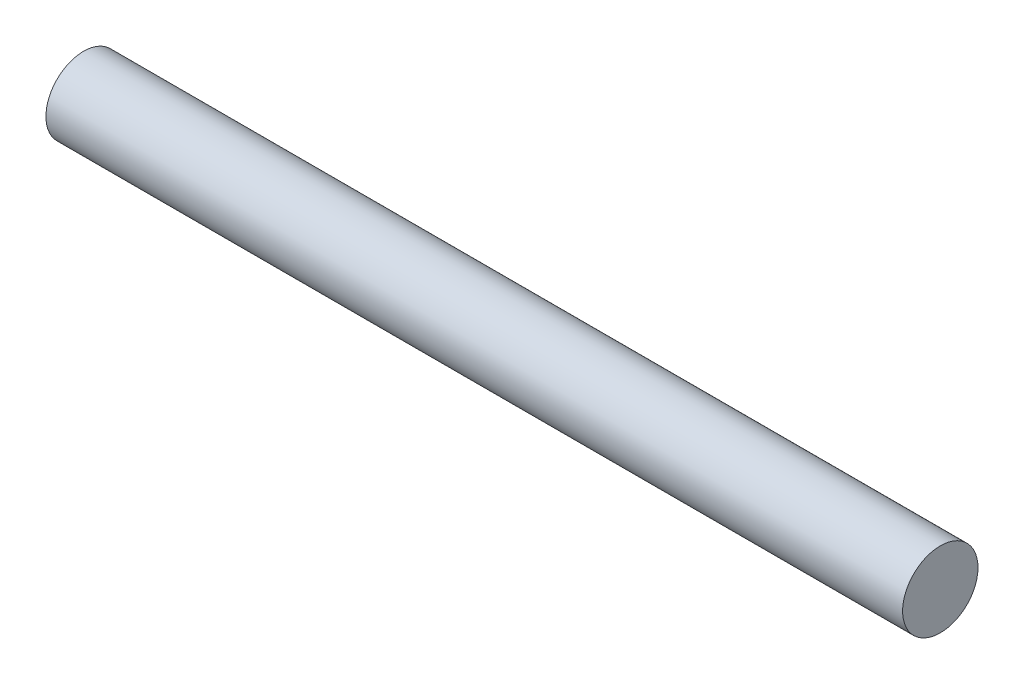
ISO-10303-21;
HEADER;
FILE_DESCRIPTION(('STEP AP214'),'2;1');
FILE_NAME('part.step','',(''),(''),'','','');
FILE_SCHEMA(('AUTOMOTIVE_DESIGN { 1 0 10303 214 1 1 1 1 }'));
ENDSEC;
DATA;
#1=APPLICATION_CONTEXT('core data for automotive mechanical design processes');
#2=APPLICATION_PROTOCOL_DEFINITION('international standard','automotive_design',2000,#1);
#3=PRODUCT_CONTEXT('',#1,'mechanical');
#4=PRODUCT('Part','Part','',(#3));
#5=PRODUCT_RELATED_PRODUCT_CATEGORY('part','',(#4));
#6=PRODUCT_DEFINITION_FORMATION('','',#4);
#7=PRODUCT_DEFINITION_CONTEXT('part definition',#1,'design');
#8=PRODUCT_DEFINITION('design','',#6,#7);
#9=PRODUCT_DEFINITION_SHAPE('','',#8);
#10=(LENGTH_UNIT() NAMED_UNIT(*) SI_UNIT(.MILLI.,.METRE.));
#11=(NAMED_UNIT(*) PLANE_ANGLE_UNIT() SI_UNIT($,.RADIAN.));
#12=(NAMED_UNIT(*) SI_UNIT($,.STERADIAN.) SOLID_ANGLE_UNIT());
#13=UNCERTAINTY_MEASURE_WITH_UNIT(LENGTH_MEASURE(1.E-05),#10,'distance_accuracy_value','');
#14=(GEOMETRIC_REPRESENTATION_CONTEXT(3) GLOBAL_UNCERTAINTY_ASSIGNED_CONTEXT((#13)) GLOBAL_UNIT_ASSIGNED_CONTEXT((#10,
#11,#12)) REPRESENTATION_CONTEXT('',''));
#15=CARTESIAN_POINT('',(0.,0.,0.));
#16=DIRECTION('',(0.,0.,1.));
#17=DIRECTION('',(1.,0.,0.));
#18=AXIS2_PLACEMENT_3D('',#15,#16,#17);
#19=CARTESIAN_POINT('',(9.525,0.,0.));
#20=DIRECTION('',(-1.,0.,0.));
#21=DIRECTION('',(0.,0.,1.));
#22=AXIS2_PLACEMENT_3D('',#19,#20,#21);
#23=CYLINDRICAL_SURFACE('',#22,0.8382);
#24=CARTESIAN_POINT('',(9.525,0.,0.));
#25=DIRECTION('',(1.,0.,0.));
#26=DIRECTION('',(0.,0.,-1.));
#27=AXIS2_PLACEMENT_3D('',#24,#25,#26);
#28=CIRCLE('',#27,0.8382);
#29=CARTESIAN_POINT('',(9.525,0.,-0.8382));
#30=VERTEX_POINT('',#29);
#31=EDGE_CURVE('E10',#30,#30,#28,.T.);
#32=ORIENTED_EDGE('',*,*,#31,.F.);
#33=EDGE_LOOP('',(#32));
#34=FACE_BOUND('',#33,.T.);
#35=CARTESIAN_POINT('',(-9.525,0.,0.));
#36=DIRECTION('',(1.,0.,0.));
#37=DIRECTION('',(0.,0.,-1.));
#38=AXIS2_PLACEMENT_3D('',#35,#36,#37);
#39=CIRCLE('',#38,0.8382);
#40=CARTESIAN_POINT('',(-9.525,0.,-0.8382));
#41=VERTEX_POINT('',#40);
#42=EDGE_CURVE('E37',#41,#41,#39,.T.);
#43=ORIENTED_EDGE('',*,*,#42,.T.);
#44=EDGE_LOOP('',(#43));
#45=FACE_BOUND('',#44,.T.);
#46=ADVANCED_FACE('F34',(#34,#45),#23,.T.);
#47=CARTESIAN_POINT('',(9.525,0.,0.));
#48=DIRECTION('',(1.,0.,0.));
#49=DIRECTION('',(0.,0.,-1.));
#50=AXIS2_PLACEMENT_3D('',#47,#48,#49);
#51=PLANE('',#50);
#52=ORIENTED_EDGE('',*,*,#31,.T.);
#53=EDGE_LOOP('',(#52));
#54=FACE_BOUND('',#53,.T.);
#55=ADVANCED_FACE('F49',(#54),#51,.T.);
#56=CARTESIAN_POINT('',(-9.525,0.,0.));
#57=DIRECTION('',(1.,0.,0.));
#58=DIRECTION('',(0.,0.,-1.));
#59=AXIS2_PLACEMENT_3D('',#56,#57,#58);
#60=PLANE('',#59);
#61=ORIENTED_EDGE('',*,*,#42,.F.);
#62=EDGE_LOOP('',(#61));
#63=FACE_BOUND('',#62,.T.);
#64=ADVANCED_FACE('F47',(#63),#60,.F.);
#65=CLOSED_SHELL('',(#46,#55,#64));
#66=MANIFOLD_SOLID_BREP('B2',#65);
#67=ADVANCED_BREP_SHAPE_REPRESENTATION('',(#18,#66),#14);
#68=SHAPE_DEFINITION_REPRESENTATION(#9,#67);
ENDSEC;
END-ISO-10303-21;
